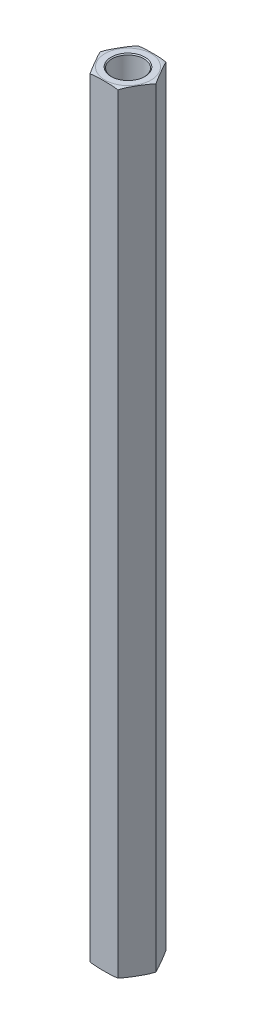
ISO-10303-21;
HEADER;
FILE_DESCRIPTION(('STEP AP214'),'2;1');
FILE_NAME('part.step','',(''),(''),'','','');
FILE_SCHEMA(('AUTOMOTIVE_DESIGN { 1 0 10303 214 1 1 1 1 }'));
ENDSEC;
DATA;
#1=APPLICATION_CONTEXT('core data for automotive mechanical design processes');
#2=APPLICATION_PROTOCOL_DEFINITION('international standard','automotive_design',2000,#1);
#3=PRODUCT_CONTEXT('',#1,'mechanical');
#4=PRODUCT('Part','Part','',(#3));
#5=PRODUCT_RELATED_PRODUCT_CATEGORY('part','',(#4));
#6=PRODUCT_DEFINITION_FORMATION('','',#4);
#7=PRODUCT_DEFINITION_CONTEXT('part definition',#1,'design');
#8=PRODUCT_DEFINITION('design','',#6,#7);
#9=PRODUCT_DEFINITION_SHAPE('','',#8);
#10=(LENGTH_UNIT() NAMED_UNIT(*) SI_UNIT(.MILLI.,.METRE.));
#11=(NAMED_UNIT(*) PLANE_ANGLE_UNIT() SI_UNIT($,.RADIAN.));
#12=(NAMED_UNIT(*) SI_UNIT($,.STERADIAN.) SOLID_ANGLE_UNIT());
#13=UNCERTAINTY_MEASURE_WITH_UNIT(LENGTH_MEASURE(1.E-05),#10,'distance_accuracy_value','');
#14=(GEOMETRIC_REPRESENTATION_CONTEXT(3) GLOBAL_UNCERTAINTY_ASSIGNED_CONTEXT((#13)) GLOBAL_UNIT_ASSIGNED_CONTEXT((#10,
#11,#12)) REPRESENTATION_CONTEXT('',''));
#15=CARTESIAN_POINT('',(0.,0.,0.));
#16=DIRECTION('',(0.,0.,1.));
#17=DIRECTION('',(1.,0.,0.));
#18=AXIS2_PLACEMENT_3D('',#15,#16,#17);
#19=CARTESIAN_POINT('',(0.,38.1,0.));
#20=DIRECTION('',(0.,1.,0.));
#21=DIRECTION('',(0.,0.,1.));
#22=AXIS2_PLACEMENT_3D('',#19,#20,#21);
#23=PLANE('',#22);
#24=CARTESIAN_POINT('',(0.,38.1,0.));
#25=DIRECTION('',(0.,1.,0.));
#26=DIRECTION('',(0.,0.,1.));
#27=AXIS2_PLACEMENT_3D('',#24,#25,#26);
#28=CIRCLE('',#27,2.0955);
#29=CARTESIAN_POINT('',(0.,38.1,2.0955));
#30=VERTEX_POINT('',#29);
#31=EDGE_CURVE('E476',#30,#30,#28,.T.);
#32=ORIENTED_EDGE('',*,*,#31,.T.);
#33=EDGE_LOOP('',(#32));
#34=FACE_BOUND('',#33,.T.);
#35=ADVANCED_FACE('F16',(#34),#23,.T.);
#36=CARTESIAN_POINT('',(0.,-38.1,0.));
#37=DIRECTION('',(0.,-1.,0.));
#38=DIRECTION('',(0.,0.,-1.));
#39=AXIS2_PLACEMENT_3D('',#36,#37,#38);
#40=PLANE('',#39);
#41=CARTESIAN_POINT('',(0.,-38.1,0.));
#42=DIRECTION('',(0.,-1.,0.));
#43=DIRECTION('',(0.,0.,-1.));
#44=AXIS2_PLACEMENT_3D('',#41,#42,#43);
#45=CIRCLE('',#44,2.0955);
#46=CARTESIAN_POINT('',(0.,-38.1,-2.0955));
#47=VERTEX_POINT('',#46);
#48=EDGE_CURVE('E132',#47,#47,#45,.T.);
#49=ORIENTED_EDGE('',*,*,#48,.T.);
#50=EDGE_LOOP('',(#49));
#51=FACE_BOUND('',#50,.T.);
#52=ADVANCED_FACE('F416',(#51),#40,.T.);
#53=CARTESIAN_POINT('',(0.,38.1,0.));
#54=DIRECTION('',(0.,1.,0.));
#55=DIRECTION('',(0.,0.,1.));
#56=AXIS2_PLACEMENT_3D('',#53,#54,#55);
#57=CYLINDRICAL_SURFACE('',#56,2.0955);
#58=CARTESIAN_POINT('',(0.,50.6729999999607,0.));
#59=DIRECTION('',(0.,1.,0.));
#60=DIRECTION('',(0.,0.,1.));
#61=AXIS2_PLACEMENT_3D('',#58,#59,#60);
#62=CIRCLE('',#61,2.09549999999581);
#63=CARTESIAN_POINT('',(0.,50.6729999999607,2.09549999999581));
#64=VERTEX_POINT('',#63);
#65=EDGE_CURVE('E130',#64,#64,#62,.T.);
#66=ORIENTED_EDGE('',*,*,#65,.T.);
#67=EDGE_LOOP('',(#66));
#68=FACE_BOUND('',#67,.T.);
#69=ORIENTED_EDGE('',*,*,#31,.F.);
#70=EDGE_LOOP('',(#69));
#71=FACE_BOUND('',#70,.T.);
#72=ADVANCED_FACE('F407',(#68,#71),#57,.F.);
#73=CARTESIAN_POINT('',(0.,-38.1,0.));
#74=DIRECTION('',(0.,-1.,0.));
#75=DIRECTION('',(0.,0.,-1.));
#76=AXIS2_PLACEMENT_3D('',#73,#74,#75);
#77=CYLINDRICAL_SURFACE('',#76,2.0955);
#78=ORIENTED_EDGE('',*,*,#48,.F.);
#79=EDGE_LOOP('',(#78));
#80=FACE_BOUND('',#79,.T.);
#81=CARTESIAN_POINT('',(0.,-50.6729999999607,0.));
#82=DIRECTION('',(0.,-1.,0.));
#83=DIRECTION('',(0.,0.,-1.));
#84=AXIS2_PLACEMENT_3D('',#81,#82,#83);
#85=CIRCLE('',#84,2.09550000005265);
#86=CARTESIAN_POINT('',(0.,-50.6729999999607,-2.09550000005265));
#87=VERTEX_POINT('',#86);
#88=EDGE_CURVE('E92',#87,#87,#85,.T.);
#89=ORIENTED_EDGE('',*,*,#88,.T.);
#90=EDGE_LOOP('',(#89));
#91=FACE_BOUND('',#90,.T.);
#92=ADVANCED_FACE('F398',(#80,#91),#77,.F.);
#93=CARTESIAN_POINT('',(0.,50.7999999999811,0.));
#94=DIRECTION('',(0.,1.,0.));
#95=DIRECTION('',(0.,0.,1.));
#96=AXIS2_PLACEMENT_3D('',#93,#94,#95);
#97=CONICAL_SURFACE('',#96,2.22249999995938,0.785398163173655);
#98=CARTESIAN_POINT('',(0.,50.7999999999811,0.));
#99=DIRECTION('',(0.,1.,0.));
#100=DIRECTION('',(0.,0.,1.));
#101=AXIS2_PLACEMENT_3D('',#98,#99,#100);
#102=CIRCLE('',#101,2.22249999995938);
#103=CARTESIAN_POINT('',(0.,50.7999999999811,2.22249999995938));
#104=VERTEX_POINT('',#103);
#105=EDGE_CURVE('E212',#104,#104,#102,.T.);
#106=ORIENTED_EDGE('',*,*,#105,.T.);
#107=EDGE_LOOP('',(#106));
#108=FACE_BOUND('',#107,.T.);
#109=ORIENTED_EDGE('',*,*,#65,.F.);
#110=EDGE_LOOP('',(#109));
#111=FACE_BOUND('',#110,.T.);
#112=ADVANCED_FACE('F390',(#108,#111),#97,.F.);
#113=CARTESIAN_POINT('',(0.,-50.7999999999242,0.));
#114=DIRECTION('',(0.,-1.,0.));
#115=DIRECTION('',(1.,0.,0.));
#116=AXIS2_PLACEMENT_3D('',#113,#114,#115);
#117=CONICAL_SURFACE('',#116,2.22249999995938,0.785398163397448);
#118=ORIENTED_EDGE('',*,*,#88,.F.);
#119=EDGE_LOOP('',(#118));
#120=FACE_BOUND('',#119,.T.);
#121=CARTESIAN_POINT('',(0.,-50.7999999999811,0.));
#122=DIRECTION('',(0.,-1.,0.));
#123=DIRECTION('',(1.,0.,0.));
#124=AXIS2_PLACEMENT_3D('',#121,#122,#123);
#125=CIRCLE('',#124,2.22250000001623);
#126=CARTESIAN_POINT('',(2.22250000001623,-50.7999999999811,0.));
#127=VERTEX_POINT('',#126);
#128=EDGE_CURVE('E207',#127,#127,#125,.F.);
#129=ORIENTED_EDGE('',*,*,#128,.F.);
#130=EDGE_LOOP('',(#129));
#131=FACE_BOUND('',#130,.T.);
#132=ADVANCED_FACE('F383',(#120,#131),#117,.F.);
#133=CARTESIAN_POINT('',(1.83308710467706,50.8,3.17499999999999));
#134=DIRECTION('',(-0.866025403784439,0.,-0.5));
#135=DIRECTION('',(-0.5,0.,0.866025403784439));
#136=AXIS2_PLACEMENT_3D('',#133,#134,#135);
#137=PLANE('',#136);
#138=DIRECTION('',(0.,1.,0.));
#139=VECTOR('',#138,1.);
#140=CARTESIAN_POINT('',(3.66617420935412,50.8,0.));
#141=LINE('',#140,#139);
#142=CARTESIAN_POINT('',(3.66617420935412,-50.673,0.));
#143=VERTEX_POINT('',#142);
#144=CARTESIAN_POINT('',(3.66617420935412,50.673,0.));
#145=VERTEX_POINT('',#144);
#146=EDGE_CURVE('E74',#143,#145,#141,.T.);
#147=ORIENTED_EDGE('',*,*,#146,.T.);
#148=CARTESIAN_POINT('',(1.83308710467706,50.673,3.175));
#149=CARTESIAN_POINT('',(1.87128169935724,50.6889014148997,3.10884502143944));
#150=CARTESIAN_POINT('',(1.90969320538961,50.7024886076105,3.04231434139612));
#151=CARTESIAN_POINT('',(1.98677079607407,50.7258161979402,2.90881203820563));
#152=CARTESIAN_POINT('',(2.02543658353272,50.7355604771397,2.8418409298126));
#153=CARTESIAN_POINT('',(2.10284499535245,50.7519966530451,2.70776562760761));
#154=CARTESIAN_POINT('',(2.14158731769806,50.7586945328669,2.64066195690181));
#155=CARTESIAN_POINT('',(2.21916296783005,50.7697767572932,2.50629698944301));
#156=CARTESIAN_POINT('',(2.25799631815347,50.774160450474,2.43903565365472));
#157=CARTESIAN_POINT('',(2.33572065438804,50.7812403004263,2.30441315431189));
#158=CARTESIAN_POINT('',(2.37461166028642,50.7839355237591,2.23705195613842));
#159=CARTESIAN_POINT('',(2.45240986808526,50.7881531983713,2.10230150749304));
#160=CARTESIAN_POINT('',(2.49131707051149,50.7896756080272,2.03491225611044));
#161=CARTESIAN_POINT('',(2.56874613804245,50.791922705889,1.90080117716413));
#162=CARTESIAN_POINT('',(2.60726795154184,50.7926552468181,1.8340794389835));
#163=CARTESIAN_POINT('',(2.68431353056975,50.7935767302574,1.7006325816086));
#164=CARTESIAN_POINT('',(2.72283729611679,50.7937656658949,1.63390746238225));
#165=CARTESIAN_POINT('',(2.79990166972106,50.7936659966806,1.50042805184618));
#166=CARTESIAN_POINT('',(2.83844227771297,50.7933771811766,1.4336737606496));
#167=CARTESIAN_POINT('',(2.91552223317789,50.792221986219,1.30016736153922));
#168=CARTESIAN_POINT('',(2.95406158061873,50.7913555970386,1.23341525368112));
#169=CARTESIAN_POINT('',(3.03113161773348,50.7887861940656,1.09992603365716));
#170=CARTESIAN_POINT('',(3.06966230777154,50.7870832271616,1.03318892086056));
#171=CARTESIAN_POINT('',(3.1467048006221,50.7824387229726,0.899747408901619));
#172=CARTESIAN_POINT('',(3.18521660427676,50.7794972471358,0.833043008280634));
#173=CARTESIAN_POINT('',(3.24841925163174,50.7732174124749,0.723572811888951));
#174=CARTESIAN_POINT('',(3.27312282066109,50.7703980110463,0.680784975201837));
#175=CARTESIAN_POINT('',(3.32249186130891,50.7638696794304,0.595275288478879));
#176=CARTESIAN_POINT('',(3.34715734368935,50.7601610809139,0.552553419802756));
#177=CARTESIAN_POINT('',(3.39643377591422,50.7516802711497,0.467204135573549));
#178=CARTESIAN_POINT('',(3.42104474295589,50.7469084657008,0.424576690233975));
#179=CARTESIAN_POINT('',(3.47026036719569,50.7360987712516,0.339332728524436));
#180=CARTESIAN_POINT('',(3.49486485317655,50.7300577313084,0.296716508711466));
#181=CARTESIAN_POINT('',(3.54398805502185,50.7165138354161,0.211632627284947));
#182=CARTESIAN_POINT('',(3.56850671785504,50.709010197803,0.169165057524208));
#183=CARTESIAN_POINT('',(3.61743974029947,50.6923203507084,0.0844105764825507));
#184=CARTESIAN_POINT('',(3.64185387349848,50.6831314978033,0.0421240573591031));
#185=CARTESIAN_POINT('',(3.66617420935412,50.673,0.));
#186=B_SPLINE_CURVE_WITH_KNOTS('',3,(#148,#149,#150,#151,#152,#153,#154,#155,#156,#157,#158,
#159,#160,#161,#162,#163,#164,#165,#166,#167,#168,#169,#170,#171,#172,#173,#174,#175,#176,#177,
#178,#179,#180,#181,#182,#183,#184,#185),.UNSPECIFIED.,.F.,.F.,(4,2,2,2,2,2,2,2,2,2,2,2,2,2,2,2,
2,2,4),(0.,0.233977307817941,0.467717675040694,0.7009969735575,0.934341903229751,
1.1678157196724,1.40129782179825,1.6324366580967,1.86357841666617,2.09482211846294,
2.32606971471495,2.55730435147398,2.78852751694413,2.93698369265087,3.08538458004473,
3.23372892334584,3.38244598546612,3.53124274626083,3.68027493713584),.UNSPECIFIED.);
#187=CARTESIAN_POINT('',(1.83308710467706,50.673,3.17499999999999));
#188=VERTEX_POINT('',#187);
#189=EDGE_CURVE('E98',#188,#145,#186,.T.);
#190=ORIENTED_EDGE('',*,*,#189,.F.);
#191=DIRECTION('',(0.,1.,0.));
#192=VECTOR('',#191,1.);
#193=CARTESIAN_POINT('',(1.83308710467706,50.8,3.17499999999999));
#194=LINE('',#193,#192);
#195=CARTESIAN_POINT('',(1.83308710467706,-50.673,3.17499999999999));
#196=VERTEX_POINT('',#195);
#197=EDGE_CURVE('E91',#188,#196,#194,.F.);
#198=ORIENTED_EDGE('',*,*,#197,.T.);
#199=CARTESIAN_POINT('',(3.66617420935412,-50.673,0.));
#200=CARTESIAN_POINT('',(3.62797961467395,-50.6889014148997,0.066154978560558));
#201=CARTESIAN_POINT('',(3.58956810864157,-50.7024886076105,0.132685658603875));
#202=CARTESIAN_POINT('',(3.51249051795711,-50.7258161979402,0.266187961794359));
#203=CARTESIAN_POINT('',(3.47382473049846,-50.7355604771397,0.33315907018739));
#204=CARTESIAN_POINT('',(3.39641631867873,-50.7519966530451,0.467234372392382));
#205=CARTESIAN_POINT('',(3.35767399633312,-50.7586945328669,0.534338043098185));
#206=CARTESIAN_POINT('',(3.28009834620113,-50.7697767572932,0.668703010556983));
#207=CARTESIAN_POINT('',(3.24126499587771,-50.774160450474,0.735964346345271));
#208=CARTESIAN_POINT('',(3.16354065964315,-50.7812403004263,0.870586845688102));
#209=CARTESIAN_POINT('',(3.12464965374476,-50.7839355237591,0.937948043861573));
#210=CARTESIAN_POINT('',(3.04685144594593,-50.7881531983713,1.07269849250695));
#211=CARTESIAN_POINT('',(3.00794424351969,-50.7896756080272,1.14008774388956));
#212=CARTESIAN_POINT('',(2.93051517598873,-50.791922705889,1.27419882283586));
#213=CARTESIAN_POINT('',(2.89199336248934,-50.7926552468181,1.34092056101649));
#214=CARTESIAN_POINT('',(2.81494778346143,-50.7935767302574,1.4743674183914));
#215=CARTESIAN_POINT('',(2.77642401791439,-50.7937656658949,1.54109253761775));
#216=CARTESIAN_POINT('',(2.69935964431012,-50.7936659966806,1.67457194815381));
#217=CARTESIAN_POINT('',(2.66081903631821,-50.7933771811766,1.7413262393504));
#218=CARTESIAN_POINT('',(2.58373908085329,-50.792221986219,1.87483263846078));
#219=CARTESIAN_POINT('',(2.54519973341245,-50.7913555970386,1.94158474631887));
#220=CARTESIAN_POINT('',(2.4681296962977,-50.7887861940656,2.07507396634283));
#221=CARTESIAN_POINT('',(2.42959900625965,-50.7870832271616,2.14181107913943));
#222=CARTESIAN_POINT('',(2.35255651340908,-50.7824387229726,2.27525259109837));
#223=CARTESIAN_POINT('',(2.31404470975442,-50.7794972471358,2.34195699171936));
#224=CARTESIAN_POINT('',(2.25084206239944,-50.7732174124749,2.45142718811104));
#225=CARTESIAN_POINT('',(2.2261384933701,-50.7703980110463,2.49421502479816));
#226=CARTESIAN_POINT('',(2.17676945272228,-50.7638696794304,2.57972471152112));
#227=CARTESIAN_POINT('',(2.15210397034183,-50.7601610809139,2.62244658019724));
#228=CARTESIAN_POINT('',(2.10282753811696,-50.7516802711497,2.70779586442645));
#229=CARTESIAN_POINT('',(2.07821657107529,-50.7469084657008,2.75042330976602));
#230=CARTESIAN_POINT('',(2.02900094683549,-50.7360987712516,2.83566727147556));
#231=CARTESIAN_POINT('',(2.00439646085463,-50.7300577313084,2.87828349128853));
#232=CARTESIAN_POINT('',(1.95527325900933,-50.7165138354161,2.96336737271505));
#233=CARTESIAN_POINT('',(1.93075459617614,-50.709010197803,3.00583494247579));
#234=CARTESIAN_POINT('',(1.88182157373171,-50.6923203507084,3.09058942351745));
#235=CARTESIAN_POINT('',(1.8574074405327,-50.6831314978033,3.13287594264089));
#236=CARTESIAN_POINT('',(1.83308710467706,-50.673,3.175));
#237=B_SPLINE_CURVE_WITH_KNOTS('',3,(#199,#200,#201,#202,#203,#204,#205,#206,#207,#208,#209,
#210,#211,#212,#213,#214,#215,#216,#217,#218,#219,#220,#221,#222,#223,#224,#225,#226,#227,#228,
#229,#230,#231,#232,#233,#234,#235,#236),.UNSPECIFIED.,.F.,.F.,(4,2,2,2,2,2,2,2,2,2,2,2,2,2,2,2,
2,2,4),(0.,0.233977307817942,0.467717675040694,0.7009969735575,0.934341903229751,
1.1678157196724,1.40129782179825,1.6324366580967,1.86357841666617,2.09482211846294,
2.32606971471495,2.55730435147398,2.78852751694413,2.93698369265087,3.08538458004473,
3.23372892334584,3.38244598546612,3.53124274626084,3.68027493713585),.UNSPECIFIED.);
#238=EDGE_CURVE('E85',#143,#196,#237,.T.);
#239=ORIENTED_EDGE('',*,*,#238,.F.);
#240=EDGE_LOOP('',(#147,#190,#198,#239));
#241=FACE_BOUND('',#240,.T.);
#242=ADVANCED_FACE('F89',(#241),#137,.F.);
#243=CARTESIAN_POINT('',(3.66617420935412,50.8,0.));
#244=DIRECTION('',(-0.866025403784439,0.,0.5));
#245=DIRECTION('',(0.5,0.,0.866025403784439));
#246=AXIS2_PLACEMENT_3D('',#243,#244,#245);
#247=PLANE('',#246);
#248=DIRECTION('',(0.,1.,0.));
#249=VECTOR('',#248,1.);
#250=CARTESIAN_POINT('',(1.83308710467706,50.8,-3.175));
#251=LINE('',#250,#249);
#252=CARTESIAN_POINT('',(1.83308710467706,-50.673,-3.175));
#253=VERTEX_POINT('',#252);
#254=CARTESIAN_POINT('',(1.83308710467706,50.673,-3.175));
#255=VERTEX_POINT('',#254);
#256=EDGE_CURVE('E168',#253,#255,#251,.T.);
#257=ORIENTED_EDGE('',*,*,#256,.T.);
#258=CARTESIAN_POINT('',(3.66617420935412,50.673,0.));
#259=CARTESIAN_POINT('',(3.62797961467395,50.6889014148997,-0.0661549785605553));
#260=CARTESIAN_POINT('',(3.58956810864157,50.7024886076105,-0.132685658603872));
#261=CARTESIAN_POINT('',(3.51249051795711,50.7258161979402,-0.266187961794356));
#262=CARTESIAN_POINT('',(3.47382473049846,50.7355604771397,-0.333159070187387));
#263=CARTESIAN_POINT('',(3.39641631867873,50.7519966530451,-0.467234372392379));
#264=CARTESIAN_POINT('',(3.35767399633312,50.7586945328669,-0.534338043098182));
#265=CARTESIAN_POINT('',(3.28009834620113,50.7697767572932,-0.66870301055698));
#266=CARTESIAN_POINT('',(3.24126499587771,50.774160450474,-0.735964346345267));
#267=CARTESIAN_POINT('',(3.16354065964315,50.7812403004263,-0.870586845688098));
#268=CARTESIAN_POINT('',(3.12464965374476,50.7839355237591,-0.937948043861569));
#269=CARTESIAN_POINT('',(3.04685144594593,50.7881531983713,-1.07269849250695));
#270=CARTESIAN_POINT('',(3.00794424351969,50.7896756080272,-1.14008774388955));
#271=CARTESIAN_POINT('',(2.93051517598873,50.791922705889,-1.27419882283586));
#272=CARTESIAN_POINT('',(2.89199336248934,50.7926552468181,-1.34092056101649));
#273=CARTESIAN_POINT('',(2.81494778346143,50.7935767302574,-1.47436741839139));
#274=CARTESIAN_POINT('',(2.77642401791439,50.7937656658949,-1.54109253761774));
#275=CARTESIAN_POINT('',(2.69935964431012,50.7936659966806,-1.67457194815381));
#276=CARTESIAN_POINT('',(2.66081903631821,50.7933771811766,-1.74132623935039));
#277=CARTESIAN_POINT('',(2.58373908085329,50.792221986219,-1.87483263846077));
#278=CARTESIAN_POINT('',(2.54519973341245,50.7913555970386,-1.94158474631887));
#279=CARTESIAN_POINT('',(2.4681296962977,50.7887861940656,-2.07507396634283));
#280=CARTESIAN_POINT('',(2.42959900625965,50.7870832271616,-2.14181107913943));
#281=CARTESIAN_POINT('',(2.35255651340908,50.7824387229726,-2.27525259109837));
#282=CARTESIAN_POINT('',(2.31404470975442,50.7794972471358,-2.34195699171935));
#283=CARTESIAN_POINT('',(2.25084206239944,50.7732174124749,-2.45142718811104));
#284=CARTESIAN_POINT('',(2.2261384933701,50.7703980110463,-2.49421502479815));
#285=CARTESIAN_POINT('',(2.17676945272227,50.7638696794304,-2.57972471152111));
#286=CARTESIAN_POINT('',(2.15210397034183,50.7601610809139,-2.62244658019724));
#287=CARTESIAN_POINT('',(2.10282753811695,50.7516802711497,-2.70779586442645));
#288=CARTESIAN_POINT('',(2.07821657107529,50.7469084657008,-2.75042330976602));
#289=CARTESIAN_POINT('',(2.02900094683549,50.7360987712516,-2.83566727147556));
#290=CARTESIAN_POINT('',(2.00439646085463,50.7300577313084,-2.87828349128853));
#291=CARTESIAN_POINT('',(1.95527325900933,50.7165138354161,-2.96336737271505));
#292=CARTESIAN_POINT('',(1.93075459617614,50.709010197803,-3.00583494247579));
#293=CARTESIAN_POINT('',(1.88182157373171,50.6923203507084,-3.09058942351745));
#294=CARTESIAN_POINT('',(1.85740744053269,50.6831314978033,-3.1328759426409));
#295=CARTESIAN_POINT('',(1.83308710467705,50.673,-3.175));
#296=B_SPLINE_CURVE_WITH_KNOTS('',3,(#258,#259,#260,#261,#262,#263,#264,#265,#266,#267,#268,
#269,#270,#271,#272,#273,#274,#275,#276,#277,#278,#279,#280,#281,#282,#283,#284,#285,#286,#287,
#288,#289,#290,#291,#292,#293,#294,#295),.UNSPECIFIED.,.F.,.F.,(4,2,2,2,2,2,2,2,2,2,2,2,2,2,2,2,
2,2,4),(0.,0.233977307817942,0.467717675040694,0.7009969735575,0.93434190322975,1.1678157196724,
1.40129782179824,1.63243665809669,1.86357841666617,2.09482211846294,2.32606971471494,
2.55730435147397,2.78852751694413,2.93698369265087,3.08538458004474,3.23372892334585,
3.38244598546613,3.53124274626085,3.68027493713586),.UNSPECIFIED.);
#297=EDGE_CURVE('E82',#145,#255,#296,.T.);
#298=ORIENTED_EDGE('',*,*,#297,.F.);
#299=ORIENTED_EDGE('',*,*,#146,.F.);
#300=CARTESIAN_POINT('',(1.83308710467706,-50.673,-3.175));
#301=CARTESIAN_POINT('',(1.87128169935723,-50.6889014148997,-3.10884502143944));
#302=CARTESIAN_POINT('',(1.90969320538961,-50.7024886076105,-3.04231434139612));
#303=CARTESIAN_POINT('',(1.98677079607407,-50.7258161979402,-2.90881203820564));
#304=CARTESIAN_POINT('',(2.02543658353271,-50.7355604771397,-2.84184092981261));
#305=CARTESIAN_POINT('',(2.10284499535244,-50.7519966530451,-2.70776562760762));
#306=CARTESIAN_POINT('',(2.14158731769805,-50.7586945328669,-2.64066195690181));
#307=CARTESIAN_POINT('',(2.21916296783004,-50.7697767572932,-2.50629698944302));
#308=CARTESIAN_POINT('',(2.25799631815347,-50.774160450474,-2.43903565365473));
#309=CARTESIAN_POINT('',(2.33572065438803,-50.7812403004263,-2.3044131543119));
#310=CARTESIAN_POINT('',(2.37461166028642,-50.7839355237591,-2.23705195613843));
#311=CARTESIAN_POINT('',(2.45240986808525,-50.7881531983713,-2.10230150749305));
#312=CARTESIAN_POINT('',(2.49131707051148,-50.7896756080272,-2.03491225611045));
#313=CARTESIAN_POINT('',(2.56874613804245,-50.791922705889,-1.90080117716414));
#314=CARTESIAN_POINT('',(2.60726795154183,-50.7926552468181,-1.83407943898351));
#315=CARTESIAN_POINT('',(2.68431353056974,-50.7935767302574,-1.70063258160861));
#316=CARTESIAN_POINT('',(2.72283729611679,-50.7937656658949,-1.63390746238225));
#317=CARTESIAN_POINT('',(2.79990166972105,-50.7936659966806,-1.50042805184619));
#318=CARTESIAN_POINT('',(2.83844227771296,-50.7933771811766,-1.43367376064961));
#319=CARTESIAN_POINT('',(2.91552223317788,-50.792221986219,-1.30016736153923));
#320=CARTESIAN_POINT('',(2.95406158061872,-50.7913555970386,-1.23341525368113));
#321=CARTESIAN_POINT('',(3.03113161773347,-50.7887861940656,-1.09992603365718));
#322=CARTESIAN_POINT('',(3.06966230777153,-50.7870832271616,-1.03318892086057));
#323=CARTESIAN_POINT('',(3.14670480062209,-50.7824387229726,-0.899747408901631));
#324=CARTESIAN_POINT('',(3.18521660427675,-50.7794972471358,-0.833043008280646));
#325=CARTESIAN_POINT('',(3.24841925163173,-50.7732174124749,-0.723572811888963));
#326=CARTESIAN_POINT('',(3.27312282066108,-50.7703980110463,-0.680784975201848));
#327=CARTESIAN_POINT('',(3.3224918613089,-50.7638696794304,-0.595275288478888));
#328=CARTESIAN_POINT('',(3.34715734368934,-50.7601610809139,-0.552553419802764));
#329=CARTESIAN_POINT('',(3.39643377591422,-50.7516802711497,-0.467204135573556));
#330=CARTESIAN_POINT('',(3.42104474295589,-50.7469084657008,-0.424576690233981));
#331=CARTESIAN_POINT('',(3.47026036719568,-50.7360987712516,-0.33933272852444));
#332=CARTESIAN_POINT('',(3.49486485317654,-50.7300577313084,-0.296716508711469));
#333=CARTESIAN_POINT('',(3.54398805502184,-50.7165138354161,-0.211632627284948));
#334=CARTESIAN_POINT('',(3.56850671785504,-50.709010197803,-0.169165057524208));
#335=CARTESIAN_POINT('',(3.61743974029947,-50.6923203507084,-0.0844105764825488));
#336=CARTESIAN_POINT('',(3.64185387349848,-50.6831314978033,-0.0421240573591002));
#337=CARTESIAN_POINT('',(3.66617420935412,-50.673,0.));
#338=B_SPLINE_CURVE_WITH_KNOTS('',3,(#300,#301,#302,#303,#304,#305,#306,#307,#308,#309,#310,
#311,#312,#313,#314,#315,#316,#317,#318,#319,#320,#321,#322,#323,#324,#325,#326,#327,#328,#329,
#330,#331,#332,#333,#334,#335,#336,#337),.UNSPECIFIED.,.F.,.F.,(4,2,2,2,2,2,2,2,2,2,2,2,2,2,2,2,
2,2,4),(0.,0.233977307817941,0.467717675040692,0.700996973557498,0.934341903229747,
1.16781571967239,1.40129782179824,1.63243665809669,1.86357841666616,2.09482211846293,
2.32606971471494,2.55730435147397,2.78852751694412,2.93698369265086,3.08538458004473,
3.23372892334584,3.38244598546612,3.53124274626084,3.68027493713585),.UNSPECIFIED.);
#339=EDGE_CURVE('E79',#253,#143,#338,.T.);
#340=ORIENTED_EDGE('',*,*,#339,.F.);
#341=EDGE_LOOP('',(#257,#298,#299,#340));
#342=FACE_BOUND('',#341,.T.);
#343=ADVANCED_FACE('F77',(#342),#247,.F.);
#344=CARTESIAN_POINT('',(-1.83308710467707,50.8,-3.175));
#345=DIRECTION('',(0.,-1.,0.));
#346=DIRECTION('',(0.,0.,-1.));
#347=AXIS2_PLACEMENT_3D('',#344,#345,#346);
#348=PLANE('',#347);
#349=CARTESIAN_POINT('',(0.,50.8,0.));
#350=DIRECTION('',(0.,-1.,0.));
#351=DIRECTION('',(0.,0.,1.));
#352=AXIS2_PLACEMENT_3D('',#349,#350,#351);
#353=CIRCLE('',#352,3.03117420935412);
#354=CARTESIAN_POINT('',(0.,50.8,3.03117420935412));
#355=VERTEX_POINT('',#354);
#356=CARTESIAN_POINT('',(0.,50.8,-3.03117420935412));
#357=VERTEX_POINT('',#356);
#358=EDGE_CURVE('E249',#355,#357,#353,.T.);
#359=ORIENTED_EDGE('',*,*,#358,.F.);
#360=CARTESIAN_POINT('',(0.,50.8,0.));
#361=DIRECTION('',(0.,-1.,0.));
#362=DIRECTION('',(0.,0.,-1.));
#363=AXIS2_PLACEMENT_3D('',#360,#361,#362);
#364=CIRCLE('',#363,3.03117420935412);
#365=EDGE_CURVE('E211',#357,#355,#364,.T.);
#366=ORIENTED_EDGE('',*,*,#365,.F.);
#367=EDGE_LOOP('',(#359,#366));
#368=FACE_BOUND('',#367,.T.);
#369=ORIENTED_EDGE('',*,*,#105,.F.);
#370=EDGE_LOOP('',(#369));
#371=FACE_BOUND('',#370,.T.);
#372=ADVANCED_FACE('F220',(#368,#371),#348,.F.);
#373=CARTESIAN_POINT('',(-1.83308710467707,-50.8,-3.175));
#374=DIRECTION('',(0.,-1.,0.));
#375=DIRECTION('',(0.,0.,-1.));
#376=AXIS2_PLACEMENT_3D('',#373,#374,#375);
#377=PLANE('',#376);
#378=CARTESIAN_POINT('',(0.,-50.8,0.));
#379=DIRECTION('',(0.,1.,0.));
#380=DIRECTION('',(0.,0.,1.));
#381=AXIS2_PLACEMENT_3D('',#378,#379,#380);
#382=CIRCLE('',#381,3.03117420935412);
#383=CARTESIAN_POINT('',(0.,-50.8,-3.03117420935412));
#384=VERTEX_POINT('',#383);
#385=CARTESIAN_POINT('',(0.,-50.8,3.03117420935412));
#386=VERTEX_POINT('',#385);
#387=EDGE_CURVE('E210',#384,#386,#382,.F.);
#388=ORIENTED_EDGE('',*,*,#387,.T.);
#389=CARTESIAN_POINT('',(0.,-50.8,0.));
#390=DIRECTION('',(0.,1.,0.));
#391=DIRECTION('',(0.,0.,-1.));
#392=AXIS2_PLACEMENT_3D('',#389,#390,#391);
#393=CIRCLE('',#392,3.03117420935412);
#394=EDGE_CURVE('E276',#384,#386,#393,.T.);
#395=ORIENTED_EDGE('',*,*,#394,.F.);
#396=EDGE_LOOP('',(#388,#395));
#397=FACE_BOUND('',#396,.T.);
#398=ORIENTED_EDGE('',*,*,#128,.T.);
#399=EDGE_LOOP('',(#398));
#400=FACE_BOUND('',#399,.T.);
#401=ADVANCED_FACE('F226',(#397,#400),#377,.T.);
#402=CARTESIAN_POINT('',(-1.83308710467707,50.8,3.175));
#403=DIRECTION('',(0.,0.,-1.));
#404=DIRECTION('',(-1.,0.,0.));
#405=AXIS2_PLACEMENT_3D('',#402,#403,#404);
#406=PLANE('',#405);
#407=ORIENTED_EDGE('',*,*,#197,.F.);
#408=CARTESIAN_POINT('',(-1.83308710467706,50.673,3.175));
#409=CARTESIAN_POINT('',(-1.73237579828684,50.6939400141518,3.175));
#410=CARTESIAN_POINT('',(-1.63096506893486,50.7108853495327,3.175));
#411=CARTESIAN_POINT('',(-1.42767146651469,50.7384971643984,3.175));
#412=CARTESIAN_POINT('',(-1.32579191427254,50.7491875658753,3.175));
#413=CARTESIAN_POINT('',(-1.12177634709138,50.7661280408079,3.175));
#414=CARTESIAN_POINT('',(-1.0196405664338,50.7723812707189,3.175));
#415=CARTESIAN_POINT('',(-0.815663681397378,50.7819028064183,3.175));
#416=CARTESIAN_POINT('',(-0.713823115514575,50.7851834044999,3.175));
#417=CARTESIAN_POINT('',(-0.510018485441652,50.7899454848703,3.175));
#418=CARTESIAN_POINT('',(-0.408054390577978,50.7914254100882,3.175));
#419=CARTESIAN_POINT('',(-0.204060200337871,50.7933146818379,3.175));
#420=CARTESIAN_POINT('',(-0.102030100168935,50.7937234241492,3.175));
#421=CARTESIAN_POINT('',(0.102030100168936,50.7937234241492,3.175));
#422=CARTESIAN_POINT('',(0.204060200337871,50.7933146818379,3.175));
#423=CARTESIAN_POINT('',(0.408054390577978,50.7914254100882,3.17499999999999));
#424=CARTESIAN_POINT('',(0.510018485441653,50.7899454848703,3.17499999999999));
#425=CARTESIAN_POINT('',(0.713823115514576,50.7851834044999,3.17499999999999));
#426=CARTESIAN_POINT('',(0.815663681397379,50.7819028064183,3.17499999999999));
#427=CARTESIAN_POINT('',(1.0196405664338,50.7723812707189,3.17499999999999));
#428=CARTESIAN_POINT('',(1.12177634709138,50.7661280408079,3.17499999999999));
#429=CARTESIAN_POINT('',(1.32579191427254,50.7491875658753,3.17499999999999));
#430=CARTESIAN_POINT('',(1.4276714665147,50.7384971643984,3.17499999999999));
#431=CARTESIAN_POINT('',(1.63096506893487,50.7108853495327,3.17499999999999));
#432=CARTESIAN_POINT('',(1.73237579828684,50.6939400141518,3.17499999999999));
#433=CARTESIAN_POINT('',(1.83308710467707,50.673,3.17499999999999));
#434=B_SPLINE_CURVE_WITH_KNOTS('',3,(#408,#409,#410,#411,#412,#413,#414,#415,#416,#417,#418,
#419,#420,#421,#422,#423,#424,#425,#426,#427,#428,#429,#430,#431,#432,#433),.UNSPECIFIED.,.F.,
.F.,(4,2,2,2,2,2,2,2,2,2,2,2,4),(0.,0.308333242342809,0.615479423308237,0.922406891130011,
1.2280592962085,1.53397581645216,1.84006485747889,2.14615389850562,2.45207041874928,
2.75772282382777,3.06465029164955,3.37179647261498,3.68012971495779),.UNSPECIFIED.);
#435=CARTESIAN_POINT('',(-1.83308710467706,50.673,3.175));
#436=VERTEX_POINT('',#435);
#437=EDGE_CURVE('E195',#436,#188,#434,.T.);
#438=ORIENTED_EDGE('',*,*,#437,.F.);
#439=DIRECTION('',(0.,1.,0.));
#440=VECTOR('',#439,1.);
#441=CARTESIAN_POINT('',(-1.83308710467707,50.8,3.175));
#442=LINE('',#441,#440);
#443=CARTESIAN_POINT('',(-1.83308710467708,-50.673,3.17499999999999));
#444=VERTEX_POINT('',#443);
#445=EDGE_CURVE('E162',#436,#444,#442,.F.);
#446=ORIENTED_EDGE('',*,*,#445,.T.);
#447=CARTESIAN_POINT('',(1.83308710467706,-50.673,3.17499999999999));
#448=CARTESIAN_POINT('',(1.73237579828684,-50.6939400141518,3.17499999999999));
#449=CARTESIAN_POINT('',(1.63096506893486,-50.7108853495327,3.17499999999999));
#450=CARTESIAN_POINT('',(1.4276714665147,-50.7384971643984,3.17499999999999));
#451=CARTESIAN_POINT('',(1.32579191427254,-50.7491875658753,3.17499999999999));
#452=CARTESIAN_POINT('',(1.12177634709138,-50.7661280408079,3.17499999999999));
#453=CARTESIAN_POINT('',(1.0196405664338,-50.7723812707189,3.17499999999999));
#454=CARTESIAN_POINT('',(0.815663681397379,-50.7819028064183,3.17499999999999));
#455=CARTESIAN_POINT('',(0.713823115514576,-50.7851834044999,3.17499999999999));
#456=CARTESIAN_POINT('',(0.510018485441653,-50.7899454848703,3.17499999999999));
#457=CARTESIAN_POINT('',(0.408054390577978,-50.7914254100882,3.17499999999999));
#458=CARTESIAN_POINT('',(0.204060200337871,-50.7933146818379,3.175));
#459=CARTESIAN_POINT('',(0.102030100168936,-50.7937234241492,3.175));
#460=CARTESIAN_POINT('',(-0.102030100168936,-50.7937234241492,3.175));
#461=CARTESIAN_POINT('',(-0.204060200337873,-50.7933146818379,3.175));
#462=CARTESIAN_POINT('',(-0.408054390577981,-50.7914254100882,3.175));
#463=CARTESIAN_POINT('',(-0.510018485441657,-50.7899454848703,3.175));
#464=CARTESIAN_POINT('',(-0.713823115514581,-50.7851834044999,3.175));
#465=CARTESIAN_POINT('',(-0.815663681397385,-50.7819028064183,3.175));
#466=CARTESIAN_POINT('',(-1.01964056643381,-50.7723812707189,3.175));
#467=CARTESIAN_POINT('',(-1.12177634709139,-50.7661280408079,3.175));
#468=CARTESIAN_POINT('',(-1.32579191427255,-50.7491875658753,3.175));
#469=CARTESIAN_POINT('',(-1.42767146651471,-50.7384971643984,3.175));
#470=CARTESIAN_POINT('',(-1.63096506893487,-50.7108853495327,3.175));
#471=CARTESIAN_POINT('',(-1.73237579828685,-50.6939400141518,3.175));
#472=CARTESIAN_POINT('',(-1.83308710467708,-50.673,3.175));
#473=B_SPLINE_CURVE_WITH_KNOTS('',3,(#447,#448,#449,#450,#451,#452,#453,#454,#455,#456,#457,
#458,#459,#460,#461,#462,#463,#464,#465,#466,#467,#468,#469,#470,#471,#472),.UNSPECIFIED.,.F.,
.F.,(4,2,2,2,2,2,2,2,2,2,2,2,4),(0.,0.308333242342809,0.615479423308237,0.922406891130012,
1.22805929620851,1.53397581645217,1.84006485747889,2.14615389850563,2.45207041874929,
2.75772282382778,3.06465029164956,3.37179647261499,3.6801297149578),.UNSPECIFIED.);
#474=EDGE_CURVE('E259',#196,#444,#473,.T.);
#475=ORIENTED_EDGE('',*,*,#474,.F.);
#476=EDGE_LOOP('',(#407,#438,#446,#475));
#477=FACE_BOUND('',#476,.T.);
#478=ADVANCED_FACE('F258',(#477),#406,.F.);
#479=CARTESIAN_POINT('',(1.83308710467706,50.8,-3.175));
#480=DIRECTION('',(0.,0.,1.));
#481=DIRECTION('',(1.,0.,0.));
#482=AXIS2_PLACEMENT_3D('',#479,#480,#481);
#483=PLANE('',#482);
#484=DIRECTION('',(0.,1.,0.));
#485=VECTOR('',#484,1.);
#486=CARTESIAN_POINT('',(-1.83308710467708,50.8,-3.17499999999999));
#487=LINE('',#486,#485);
#488=CARTESIAN_POINT('',(-1.83308710467708,-50.673,-3.175));
#489=VERTEX_POINT('',#488);
#490=CARTESIAN_POINT('',(-1.83308710467706,50.673,-3.17500000000001));
#491=VERTEX_POINT('',#490);
#492=EDGE_CURVE('E160',#489,#491,#487,.T.);
#493=ORIENTED_EDGE('',*,*,#492,.T.);
#494=CARTESIAN_POINT('',(1.83308710467706,50.673,-3.175));
#495=CARTESIAN_POINT('',(1.73237579828683,50.6939400141518,-3.175));
#496=CARTESIAN_POINT('',(1.63096506893486,50.7108853495327,-3.175));
#497=CARTESIAN_POINT('',(1.42767146651469,50.7384971643984,-3.175));
#498=CARTESIAN_POINT('',(1.32579191427254,50.7491875658753,-3.175));
#499=CARTESIAN_POINT('',(1.12177634709137,50.7661280408079,-3.175));
#500=CARTESIAN_POINT('',(1.0196405664338,50.7723812707189,-3.175));
#501=CARTESIAN_POINT('',(0.815663681397375,50.7819028064183,-3.175));
#502=CARTESIAN_POINT('',(0.713823115514573,50.7851834044999,-3.175));
#503=CARTESIAN_POINT('',(0.510018485441651,50.7899454848703,-3.175));
#504=CARTESIAN_POINT('',(0.408054390577976,50.7914254100882,-3.175));
#505=CARTESIAN_POINT('',(0.204060200337871,50.7933146818379,-3.175));
#506=CARTESIAN_POINT('',(0.102030100168935,50.7937234241492,-3.17500000000001));
#507=CARTESIAN_POINT('',(-0.102030100168935,50.7937234241492,-3.17500000000001));
#508=CARTESIAN_POINT('',(-0.204060200337869,50.7933146818379,-3.175));
#509=CARTESIAN_POINT('',(-0.408054390577975,50.7914254100882,-3.175));
#510=CARTESIAN_POINT('',(-0.510018485441649,50.7899454848703,-3.175));
#511=CARTESIAN_POINT('',(-0.713823115514571,50.7851834044999,-3.175));
#512=CARTESIAN_POINT('',(-0.815663681397373,50.7819028064183,-3.175));
#513=CARTESIAN_POINT('',(-1.01964056643379,50.7723812707189,-3.175));
#514=CARTESIAN_POINT('',(-1.12177634709137,50.7661280408079,-3.175));
#515=CARTESIAN_POINT('',(-1.32579191427253,50.7491875658753,-3.175));
#516=CARTESIAN_POINT('',(-1.42767146651469,50.7384971643984,-3.175));
#517=CARTESIAN_POINT('',(-1.63096506893485,50.7108853495327,-3.175));
#518=CARTESIAN_POINT('',(-1.73237579828683,50.6939400141518,-3.175));
#519=CARTESIAN_POINT('',(-1.83308710467705,50.673,-3.17500000000001));
#520=B_SPLINE_CURVE_WITH_KNOTS('',3,(#494,#495,#496,#497,#498,#499,#500,#501,#502,#503,#504,
#505,#506,#507,#508,#509,#510,#511,#512,#513,#514,#515,#516,#517,#518,#519),.UNSPECIFIED.,.F.,
.F.,(4,2,2,2,2,2,2,2,2,2,2,2,4),(0.,0.308333242342807,0.615479423308235,0.922406891130008,
1.2280592962085,1.53397581645216,1.84006485747889,2.14615389850561,2.45207041874927,
2.75772282382776,3.06465029164954,3.37179647261496,3.68012971495777),.UNSPECIFIED.);
#521=EDGE_CURVE('E201',#255,#491,#520,.T.);
#522=ORIENTED_EDGE('',*,*,#521,.F.);
#523=ORIENTED_EDGE('',*,*,#256,.F.);
#524=CARTESIAN_POINT('',(-1.83308710467708,-50.673,-3.17500000000001));
#525=CARTESIAN_POINT('',(-1.73237579828685,-50.6939400141518,-3.175));
#526=CARTESIAN_POINT('',(-1.63096506893487,-50.7108853495327,-3.175));
#527=CARTESIAN_POINT('',(-1.42767146651471,-50.7384971643984,-3.175));
#528=CARTESIAN_POINT('',(-1.32579191427255,-50.7491875658753,-3.175));
#529=CARTESIAN_POINT('',(-1.12177634709139,-50.7661280408079,-3.175));
#530=CARTESIAN_POINT('',(-1.01964056643381,-50.7723812707189,-3.175));
#531=CARTESIAN_POINT('',(-0.815663681397383,-50.7819028064183,-3.175));
#532=CARTESIAN_POINT('',(-0.713823115514579,-50.7851834044999,-3.175));
#533=CARTESIAN_POINT('',(-0.510018485441655,-50.7899454848703,-3.175));
#534=CARTESIAN_POINT('',(-0.40805439057798,-50.7914254100882,-3.175));
#535=CARTESIAN_POINT('',(-0.204060200337871,-50.7933146818379,-3.175));
#536=CARTESIAN_POINT('',(-0.102030100168935,-50.7937234241492,-3.17500000000001));
#537=CARTESIAN_POINT('',(0.102030100168936,-50.7937234241492,-3.17500000000001));
#538=CARTESIAN_POINT('',(0.204060200337872,-50.7933146818379,-3.175));
#539=CARTESIAN_POINT('',(0.408054390577978,-50.7914254100882,-3.175));
#540=CARTESIAN_POINT('',(0.510018485441653,-50.7899454848703,-3.175));
#541=CARTESIAN_POINT('',(0.713823115514575,-50.7851834044999,-3.175));
#542=CARTESIAN_POINT('',(0.815663681397378,-50.7819028064183,-3.175));
#543=CARTESIAN_POINT('',(1.0196405664338,-50.7723812707189,-3.175));
#544=CARTESIAN_POINT('',(1.12177634709138,-50.7661280408079,-3.175));
#545=CARTESIAN_POINT('',(1.32579191427254,-50.7491875658753,-3.175));
#546=CARTESIAN_POINT('',(1.42767146651469,-50.7384971643984,-3.175));
#547=CARTESIAN_POINT('',(1.63096506893486,-50.7108853495327,-3.175));
#548=CARTESIAN_POINT('',(1.73237579828684,-50.6939400141518,-3.175));
#549=CARTESIAN_POINT('',(1.83308710467706,-50.673,-3.175));
#550=B_SPLINE_CURVE_WITH_KNOTS('',3,(#524,#525,#526,#527,#528,#529,#530,#531,#532,#533,#534,
#535,#536,#537,#538,#539,#540,#541,#542,#543,#544,#545,#546,#547,#548,#549),.UNSPECIFIED.,.F.,
.F.,(4,2,2,2,2,2,2,2,2,2,2,2,4),(0.,0.308333242342811,0.615479423308243,0.922406891130019,
1.22805929620851,1.53397581645218,1.84006485747891,2.14615389850564,2.4520704187493,
2.75772282382779,3.06465029164956,3.37179647261499,3.6801297149578),.UNSPECIFIED.);
#551=EDGE_CURVE('E97',#489,#253,#550,.T.);
#552=ORIENTED_EDGE('',*,*,#551,.F.);
#553=EDGE_LOOP('',(#493,#522,#523,#552));
#554=FACE_BOUND('',#553,.T.);
#555=ADVANCED_FACE('F174',(#554),#483,.F.);
#556=CARTESIAN_POINT('',(0.,49.149,0.));
#557=DIRECTION('',(0.,1.,0.));
#558=DIRECTION('',(0.,0.,1.));
#559=AXIS2_PLACEMENT_3D('',#556,#557,#558);
#560=TOROIDAL_SURFACE('',#559,3.03117420935412,1.65099999999997);
#561=ORIENTED_EDGE('',*,*,#358,.T.);
#562=ORIENTED_EDGE('',*,*,#365,.T.);
#563=EDGE_LOOP('',(#561,#562));
#564=FACE_BOUND('',#563,.T.);
#565=ORIENTED_EDGE('',*,*,#437,.T.);
#566=ORIENTED_EDGE('',*,*,#189,.T.);
#567=ORIENTED_EDGE('',*,*,#297,.T.);
#568=ORIENTED_EDGE('',*,*,#521,.T.);
#569=CARTESIAN_POINT('',(-1.83308710467706,50.673,-3.17500000000001));
#570=CARTESIAN_POINT('',(-1.87128169935723,50.6889014148997,-3.10884502143946));
#571=CARTESIAN_POINT('',(-1.90969320538961,50.7024886076105,-3.04231434139614));
#572=CARTESIAN_POINT('',(-1.98677079607407,50.7258161979402,-2.90881203820566));
#573=CARTESIAN_POINT('',(-2.02543658353271,50.7355604771397,-2.84184092981263));
#574=CARTESIAN_POINT('',(-2.10284499535244,50.7519966530451,-2.70776562760764));
#575=CARTESIAN_POINT('',(-2.14158731769805,50.7586945328669,-2.64066195690184));
#576=CARTESIAN_POINT('',(-2.21916296783004,50.7697767572932,-2.50629698944305));
#577=CARTESIAN_POINT('',(-2.25799631815346,50.774160450474,-2.43903565365476));
#578=CARTESIAN_POINT('',(-2.33572065438802,50.7812403004263,-2.30441315431194));
#579=CARTESIAN_POINT('',(-2.37461166028641,50.7839355237591,-2.23705195613847));
#580=CARTESIAN_POINT('',(-2.45240986808524,50.7881531983713,-2.10230150749309));
#581=CARTESIAN_POINT('',(-2.49131707051147,50.7896756080272,-2.03491225611049));
#582=CARTESIAN_POINT('',(-2.56874613804243,50.791922705889,-1.90080117716418));
#583=CARTESIAN_POINT('',(-2.60726795154182,50.7926552468181,-1.83407943898355));
#584=CARTESIAN_POINT('',(-2.68431353056972,50.7935767302574,-1.70063258160866));
#585=CARTESIAN_POINT('',(-2.72283729611677,50.7937656658949,-1.63390746238231));
#586=CARTESIAN_POINT('',(-2.79990166972103,50.7936659966806,-1.50042805184625));
#587=CARTESIAN_POINT('',(-2.83844227771294,50.7933771811766,-1.43367376064966));
#588=CARTESIAN_POINT('',(-2.91552223317786,50.792221986219,-1.30016736153929));
#589=CARTESIAN_POINT('',(-2.9540615806187,50.7913555970386,-1.23341525368119));
#590=CARTESIAN_POINT('',(-3.03113161773345,50.7887861940656,-1.09992603365724));
#591=CARTESIAN_POINT('',(-3.0696623077715,50.7870832271616,-1.03318892086064));
#592=CARTESIAN_POINT('',(-3.14670480062206,50.7824387229726,-0.8997474089017));
#593=CARTESIAN_POINT('',(-3.18521660427672,50.7794972471358,-0.833043008280716));
#594=CARTESIAN_POINT('',(-3.2484192516317,50.7732174124749,-0.723572811889031));
#595=CARTESIAN_POINT('',(-3.27312282066105,50.7703980110463,-0.680784975201912));
#596=CARTESIAN_POINT('',(-3.32249186130888,50.7638696794304,-0.595275288478944));
#597=CARTESIAN_POINT('',(-3.34715734368932,50.7601610809139,-0.552553419802817));
#598=CARTESIAN_POINT('',(-3.3964337759142,50.7516802711497,-0.4672041355736));
#599=CARTESIAN_POINT('',(-3.42104474295588,50.7469084657008,-0.424576690234022));
#600=CARTESIAN_POINT('',(-3.47026036719567,50.7360987712516,-0.339332728524473));
#601=CARTESIAN_POINT('',(-3.49486485317654,50.7300577313084,-0.296716508711498));
#602=CARTESIAN_POINT('',(-3.54398805502184,50.7165138354161,-0.21163262728497));
#603=CARTESIAN_POINT('',(-3.56850671785504,50.709010197803,-0.169165057524226));
#604=CARTESIAN_POINT('',(-3.61743974029947,50.6923203507084,-0.0844105764825594));
#605=CARTESIAN_POINT('',(-3.64185387349849,50.6831314978033,-0.042124057359107));
#606=CARTESIAN_POINT('',(-3.66617420935413,50.673,0.));
#607=B_SPLINE_CURVE_WITH_KNOTS('',3,(#569,#570,#571,#572,#573,#574,#575,#576,#577,#578,#579,
#580,#581,#582,#583,#584,#585,#586,#587,#588,#589,#590,#591,#592,#593,#594,#595,#596,#597,#598,
#599,#600,#601,#602,#603,#604,#605,#606),.UNSPECIFIED.,.F.,.F.,(4,2,2,2,2,2,2,2,2,2,2,2,2,2,2,2,
2,2,4),(0.,0.233977307817937,0.467717675040683,0.700996973557482,0.934341903229726,
1.16781571967236,1.40129782179821,1.63243665809665,1.86357841666612,2.09482211846289,
2.32606971471488,2.55730435147391,2.78852751694406,2.93698369265081,3.08538458004469,
3.23372892334582,3.38244598546611,3.53124274626084,3.68027493713587),.UNSPECIFIED.);
#608=CARTESIAN_POINT('',(-3.66617420935413,50.673,0.));
#609=VERTEX_POINT('',#608);
#610=EDGE_CURVE('E139',#491,#609,#607,.T.);
#611=ORIENTED_EDGE('',*,*,#610,.T.);
#612=CARTESIAN_POINT('',(-3.66617420935412,50.673,0.));
#613=CARTESIAN_POINT('',(-3.62797961467395,50.6889014148997,0.0661549785605622));
#614=CARTESIAN_POINT('',(-3.58956810864157,50.7024886076105,0.132685658603879));
#615=CARTESIAN_POINT('',(-3.51249051795711,50.7258161979402,0.266187961794363));
#616=CARTESIAN_POINT('',(-3.47382473049847,50.7355604771397,0.333159070187394));
#617=CARTESIAN_POINT('',(-3.39641631867873,50.7519966530451,0.467234372392385));
#618=CARTESIAN_POINT('',(-3.35767399633313,50.7586945328669,0.534338043098188));
#619=CARTESIAN_POINT('',(-3.28009834620114,50.7697767572932,0.668703010556986));
#620=CARTESIAN_POINT('',(-3.24126499587771,50.774160450474,0.735964346345274));
#621=CARTESIAN_POINT('',(-3.16354065964315,50.7812403004263,0.870586845688104));
#622=CARTESIAN_POINT('',(-3.12464965374476,50.7839355237591,0.937948043861576));
#623=CARTESIAN_POINT('',(-3.04685144594593,50.7881531983713,1.07269849250695));
#624=CARTESIAN_POINT('',(-3.0079442435197,50.7896756080272,1.14008774388956));
#625=CARTESIAN_POINT('',(-2.93051517598873,50.791922705889,1.27419882283587));
#626=CARTESIAN_POINT('',(-2.89199336248935,50.7926552468181,1.3409205610165));
#627=CARTESIAN_POINT('',(-2.81494778346144,50.7935767302574,1.4743674183914));
#628=CARTESIAN_POINT('',(-2.77642401791439,50.7937656658949,1.54109253761775));
#629=CARTESIAN_POINT('',(-2.69935964431013,50.7936659966806,1.67457194815381));
#630=CARTESIAN_POINT('',(-2.66081903631822,50.7933771811766,1.7413262393504));
#631=CARTESIAN_POINT('',(-2.5837390808533,50.792221986219,1.87483263846078));
#632=CARTESIAN_POINT('',(-2.54519973341245,50.7913555970386,1.94158474631887));
#633=CARTESIAN_POINT('',(-2.46812969629771,50.7887861940656,2.07507396634283));
#634=CARTESIAN_POINT('',(-2.42959900625965,50.7870832271616,2.14181107913943));
#635=CARTESIAN_POINT('',(-2.35255651340909,50.7824387229726,2.27525259109838));
#636=CARTESIAN_POINT('',(-2.31404470975443,50.7794972471358,2.34195699171936));
#637=CARTESIAN_POINT('',(-2.25084206239945,50.7732174124749,2.45142718811105));
#638=CARTESIAN_POINT('',(-2.2261384933701,50.7703980110463,2.49421502479816));
#639=CARTESIAN_POINT('',(-2.17676945272228,50.7638696794304,2.57972471152112));
#640=CARTESIAN_POINT('',(-2.15210397034184,50.7601610809139,2.62244658019724));
#641=CARTESIAN_POINT('',(-2.10282753811696,50.7516802711497,2.70779586442645));
#642=CARTESIAN_POINT('',(-2.07821657107529,50.7469084657008,2.75042330976602));
#643=CARTESIAN_POINT('',(-2.0290009468355,50.7360987712516,2.83566727147556));
#644=CARTESIAN_POINT('',(-2.00439646085464,50.7300577313084,2.87828349128853));
#645=CARTESIAN_POINT('',(-1.95527325900934,50.7165138354161,2.96336737271505));
#646=CARTESIAN_POINT('',(-1.93075459617615,50.709010197803,3.0058349424758));
#647=CARTESIAN_POINT('',(-1.88182157373172,50.6923203507084,3.09058942351745));
#648=CARTESIAN_POINT('',(-1.8574074405327,50.6831314978033,3.1328759426409));
#649=CARTESIAN_POINT('',(-1.83308710467707,50.673,3.175));
#650=B_SPLINE_CURVE_WITH_KNOTS('',3,(#612,#613,#614,#615,#616,#617,#618,#619,#620,#621,#622,
#623,#624,#625,#626,#627,#628,#629,#630,#631,#632,#633,#634,#635,#636,#637,#638,#639,#640,#641,
#642,#643,#644,#645,#646,#647,#648,#649),.UNSPECIFIED.,.F.,.F.,(4,2,2,2,2,2,2,2,2,2,2,2,2,2,2,2,
2,2,4),(0.,0.233977307817942,0.467717675040693,0.700996973557499,0.934341903229749,
1.1678157196724,1.40129782179824,1.63243665809669,1.86357841666617,2.09482211846294,
2.32606971471494,2.55730435147397,2.78852751694413,2.93698369265087,3.08538458004473,
3.23372892334584,3.38244598546612,3.53124274626084,3.68027493713585),.UNSPECIFIED.);
#651=EDGE_CURVE('E165',#609,#436,#650,.T.);
#652=ORIENTED_EDGE('',*,*,#651,.T.);
#653=EDGE_LOOP('',(#565,#566,#567,#568,#611,#652));
#654=FACE_BOUND('',#653,.T.);
#655=ADVANCED_FACE('F170',(#564,#654),#560,.T.);
#656=CARTESIAN_POINT('',(-3.66617420935413,50.8,0.));
#657=DIRECTION('',(0.866025403784439,0.,-0.499999999999999));
#658=DIRECTION('',(-0.499999999999999,0.,-0.866025403784439));
#659=AXIS2_PLACEMENT_3D('',#656,#657,#658);
#660=PLANE('',#659);
#661=ORIENTED_EDGE('',*,*,#445,.F.);
#662=ORIENTED_EDGE('',*,*,#651,.F.);
#663=DIRECTION('',(0.,1.,0.));
#664=VECTOR('',#663,1.);
#665=CARTESIAN_POINT('',(-3.66617420935413,50.8,0.));
#666=LINE('',#665,#664);
#667=CARTESIAN_POINT('',(-3.66617420935413,-50.673,0.));
#668=VERTEX_POINT('',#667);
#669=EDGE_CURVE('E27',#609,#668,#666,.F.);
#670=ORIENTED_EDGE('',*,*,#669,.T.);
#671=CARTESIAN_POINT('',(-1.83308710467707,-50.673,3.17499999999999));
#672=CARTESIAN_POINT('',(-1.87128169935725,-50.6889014148997,3.10884502143943));
#673=CARTESIAN_POINT('',(-1.90969320538963,-50.7024886076105,3.04231434139611));
#674=CARTESIAN_POINT('',(-1.98677079607409,-50.7258161979402,2.90881203820563));
#675=CARTESIAN_POINT('',(-2.02543658353273,-50.7355604771397,2.8418409298126));
#676=CARTESIAN_POINT('',(-2.10284499535246,-50.7519966530451,2.70776562760761));
#677=CARTESIAN_POINT('',(-2.14158731769807,-50.7586945328669,2.6406619569018));
#678=CARTESIAN_POINT('',(-2.21916296783006,-50.7697767572932,2.506296989443));
#679=CARTESIAN_POINT('',(-2.25799631815348,-50.774160450474,2.43903565365472));
#680=CARTESIAN_POINT('',(-2.33572065438805,-50.7812403004263,2.30441315431189));
#681=CARTESIAN_POINT('',(-2.37461166028644,-50.7839355237591,2.23705195613841));
#682=CARTESIAN_POINT('',(-2.45240986808527,-50.7881531983713,2.10230150749304));
#683=CARTESIAN_POINT('',(-2.4913170705115,-50.7896756080272,2.03491225611043));
#684=CARTESIAN_POINT('',(-2.56874613804246,-50.791922705889,1.90080117716412));
#685=CARTESIAN_POINT('',(-2.60726795154185,-50.7926552468181,1.83407943898349));
#686=CARTESIAN_POINT('',(-2.68431353056976,-50.7935767302574,1.70063258160859));
#687=CARTESIAN_POINT('',(-2.7228372961168,-50.7937656658949,1.63390746238224));
#688=CARTESIAN_POINT('',(-2.79990166972107,-50.7936659966806,1.50042805184617));
#689=CARTESIAN_POINT('',(-2.83844227771298,-50.7933771811766,1.43367376064959));
#690=CARTESIAN_POINT('',(-2.9155222331779,-50.792221986219,1.30016736153921));
#691=CARTESIAN_POINT('',(-2.95406158061875,-50.7913555970386,1.23341525368111));
#692=CARTESIAN_POINT('',(-3.03113161773349,-50.7887861940656,1.09992603365715));
#693=CARTESIAN_POINT('',(-3.06966230777155,-50.7870832271616,1.03318892086055));
#694=CARTESIAN_POINT('',(-3.14670480062211,-50.7824387229726,0.899747408901609));
#695=CARTESIAN_POINT('',(-3.18521660427677,-50.7794972471358,0.833043008280623));
#696=CARTESIAN_POINT('',(-3.24841925163175,-50.7732174124749,0.72357281188894));
#697=CARTESIAN_POINT('',(-3.2731228206611,-50.7703980110463,0.680784975201827));
#698=CARTESIAN_POINT('',(-3.32249186130892,-50.7638696794304,0.59527528847887));
#699=CARTESIAN_POINT('',(-3.34715734368936,-50.7601610809139,0.552553419802747));
#700=CARTESIAN_POINT('',(-3.39643377591423,-50.7516802711497,0.467204135573541));
#701=CARTESIAN_POINT('',(-3.4210447429559,-50.7469084657008,0.424576690233968));
#702=CARTESIAN_POINT('',(-3.47026036719569,-50.7360987712516,0.33933272852443));
#703=CARTESIAN_POINT('',(-3.49486485317656,-50.7300577313084,0.29671650871146));
#704=CARTESIAN_POINT('',(-3.54398805502186,-50.7165138354161,0.211632627284942));
#705=CARTESIAN_POINT('',(-3.56850671785505,-50.709010197803,0.169165057524203));
#706=CARTESIAN_POINT('',(-3.61743974029947,-50.6923203507084,0.0844105764825456));
#707=CARTESIAN_POINT('',(-3.64185387349849,-50.6831314978033,0.0421240573590976));
#708=CARTESIAN_POINT('',(-3.66617420935412,-50.673,0.));
#709=B_SPLINE_CURVE_WITH_KNOTS('',3,(#671,#672,#673,#674,#675,#676,#677,#678,#679,#680,#681,
#682,#683,#684,#685,#686,#687,#688,#689,#690,#691,#692,#693,#694,#695,#696,#697,#698,#699,#700,
#701,#702,#703,#704,#705,#706,#707,#708),.UNSPECIFIED.,.F.,.F.,(4,2,2,2,2,2,2,2,2,2,2,2,2,2,2,2,
2,2,4),(0.,0.233977307817941,0.467717675040694,0.700996973557501,0.934341903229751,
1.1678157196724,1.40129782179825,1.6324366580967,1.86357841666617,2.09482211846294,
2.32606971471495,2.55730435147398,2.78852751694413,2.93698369265087,3.08538458004474,
3.23372892334584,3.38244598546612,3.53124274626083,3.68027493713584),.UNSPECIFIED.);
#710=EDGE_CURVE('E35',#444,#668,#709,.T.);
#711=ORIENTED_EDGE('',*,*,#710,.F.);
#712=EDGE_LOOP('',(#661,#662,#670,#711));
#713=FACE_BOUND('',#712,.T.);
#714=ADVANCED_FACE('F152',(#713),#660,.F.);
#715=CARTESIAN_POINT('',(0.,-49.149,0.));
#716=DIRECTION('',(0.,-1.,0.));
#717=DIRECTION('',(0.,0.,1.));
#718=AXIS2_PLACEMENT_3D('',#715,#716,#717);
#719=TOROIDAL_SURFACE('',#718,3.03117420935412,1.65099999999997);
#720=ORIENTED_EDGE('',*,*,#551,.T.);
#721=ORIENTED_EDGE('',*,*,#339,.T.);
#722=ORIENTED_EDGE('',*,*,#238,.T.);
#723=ORIENTED_EDGE('',*,*,#474,.T.);
#724=ORIENTED_EDGE('',*,*,#710,.T.);
#725=CARTESIAN_POINT('',(-3.66617420935413,-50.673,0.));
#726=CARTESIAN_POINT('',(-3.62797961467395,-50.6889014148997,-0.0661549785605628));
#727=CARTESIAN_POINT('',(-3.58956810864158,-50.7024886076105,-0.13268565860388));
#728=CARTESIAN_POINT('',(-3.51249051795712,-50.7258161979402,-0.266187961794362));
#729=CARTESIAN_POINT('',(-3.47382473049847,-50.7355604771397,-0.333159070187393));
#730=CARTESIAN_POINT('',(-3.39641631867874,-50.7519966530451,-0.467234372392383));
#731=CARTESIAN_POINT('',(-3.35767399633313,-50.7586945328669,-0.534338043098185));
#732=CARTESIAN_POINT('',(-3.28009834620114,-50.7697767572932,-0.668703010556982));
#733=CARTESIAN_POINT('',(-3.24126499587772,-50.774160450474,-0.735964346345269));
#734=CARTESIAN_POINT('',(-3.16354065964316,-50.7812403004263,-0.870586845688098));
#735=CARTESIAN_POINT('',(-3.12464965374477,-50.7839355237591,-0.937948043861569));
#736=CARTESIAN_POINT('',(-3.04685144594594,-50.7881531983713,-1.07269849250694));
#737=CARTESIAN_POINT('',(-3.0079442435197,-50.7896756080272,-1.14008774388955));
#738=CARTESIAN_POINT('',(-2.93051517598874,-50.791922705889,-1.27419882283586));
#739=CARTESIAN_POINT('',(-2.89199336248936,-50.7926552468181,-1.34092056101649));
#740=CARTESIAN_POINT('',(-2.81494778346145,-50.7935767302574,-1.47436741839139));
#741=CARTESIAN_POINT('',(-2.7764240179144,-50.7937656658949,-1.54109253761774));
#742=CARTESIAN_POINT('',(-2.69935964431014,-50.7936659966806,-1.6745719481538));
#743=CARTESIAN_POINT('',(-2.66081903631823,-50.7933771811766,-1.74132623935038));
#744=CARTESIAN_POINT('',(-2.58373908085331,-50.792221986219,-1.87483263846077));
#745=CARTESIAN_POINT('',(-2.54519973341247,-50.7913555970386,-1.94158474631886));
#746=CARTESIAN_POINT('',(-2.46812969629772,-50.7887861940656,-2.07507396634282));
#747=CARTESIAN_POINT('',(-2.42959900625966,-50.7870832271616,-2.14181107913942));
#748=CARTESIAN_POINT('',(-2.3525565134091,-50.7824387229726,-2.27525259109836));
#749=CARTESIAN_POINT('',(-2.31404470975444,-50.7794972471358,-2.34195699171934));
#750=CARTESIAN_POINT('',(-2.25084206239946,-50.7732174124749,-2.45142718811103));
#751=CARTESIAN_POINT('',(-2.22613849337011,-50.7703980110463,-2.49421502479814));
#752=CARTESIAN_POINT('',(-2.17676945272229,-50.7638696794304,-2.5797247115211));
#753=CARTESIAN_POINT('',(-2.15210397034185,-50.7601610809139,-2.62244658019722));
#754=CARTESIAN_POINT('',(-2.10282753811697,-50.7516802711497,-2.70779586442643));
#755=CARTESIAN_POINT('',(-2.0782165710753,-50.7469084657008,-2.75042330976601));
#756=CARTESIAN_POINT('',(-2.02900094683551,-50.7360987712516,-2.83566727147555));
#757=CARTESIAN_POINT('',(-2.00439646085465,-50.7300577313084,-2.87828349128852));
#758=CARTESIAN_POINT('',(-1.95527325900935,-50.7165138354161,-2.96336737271504));
#759=CARTESIAN_POINT('',(-1.93075459617616,-50.709010197803,-3.00583494247578));
#760=CARTESIAN_POINT('',(-1.88182157373173,-50.6923203507084,-3.09058942351744));
#761=CARTESIAN_POINT('',(-1.85740744053271,-50.6831314978033,-3.13287594264089));
#762=CARTESIAN_POINT('',(-1.83308710467707,-50.673,-3.17499999999999));
#763=B_SPLINE_CURVE_WITH_KNOTS('',3,(#725,#726,#727,#728,#729,#730,#731,#732,#733,#734,#735,
#736,#737,#738,#739,#740,#741,#742,#743,#744,#745,#746,#747,#748,#749,#750,#751,#752,#753,#754,
#755,#756,#757,#758,#759,#760,#761,#762),.UNSPECIFIED.,.F.,.F.,(4,2,2,2,2,2,2,2,2,2,2,2,2,2,2,2,
2,2,4),(0.,0.233977307817941,0.467717675040691,0.700996973557495,0.934341903229743,
1.16781571967239,1.40129782179823,1.63243665809668,1.86357841666615,2.09482211846292,
2.32606971471493,2.55730435147395,2.78852751694411,2.93698369265085,3.08538458004472,
3.23372892334583,3.38244598546611,3.53124274626082,3.68027493713584),.UNSPECIFIED.);
#764=EDGE_CURVE('E11',#668,#489,#763,.T.);
#765=ORIENTED_EDGE('',*,*,#764,.T.);
#766=EDGE_LOOP('',(#720,#721,#722,#723,#724,#765));
#767=FACE_BOUND('',#766,.T.);
#768=ORIENTED_EDGE('',*,*,#387,.F.);
#769=ORIENTED_EDGE('',*,*,#394,.T.);
#770=EDGE_LOOP('',(#768,#769));
#771=FACE_BOUND('',#770,.T.);
#772=ADVANCED_FACE('F94',(#767,#771),#719,.T.);
#773=CARTESIAN_POINT('',(-1.83308710467707,50.8,-3.175));
#774=DIRECTION('',(0.866025403784439,0.,0.5));
#775=DIRECTION('',(0.5,0.,-0.866025403784439));
#776=AXIS2_PLACEMENT_3D('',#773,#774,#775);
#777=PLANE('',#776);
#778=ORIENTED_EDGE('',*,*,#669,.F.);
#779=ORIENTED_EDGE('',*,*,#610,.F.);
#780=ORIENTED_EDGE('',*,*,#492,.F.);
#781=ORIENTED_EDGE('',*,*,#764,.F.);
#782=EDGE_LOOP('',(#778,#779,#780,#781));
#783=FACE_BOUND('',#782,.T.);
#784=ADVANCED_FACE('F146',(#783),#777,.F.);
#785=CLOSED_SHELL('',(#35,#52,#72,#92,#112,#132,#242,#343,#372,#401,#478,#555,#655,#714,#772,#784));
#786=MANIFOLD_SOLID_BREP('B1',#785);
#787=ADVANCED_BREP_SHAPE_REPRESENTATION('',(#18,#786),#14);
#788=SHAPE_DEFINITION_REPRESENTATION(#9,#787);
ENDSEC;
END-ISO-10303-21;
